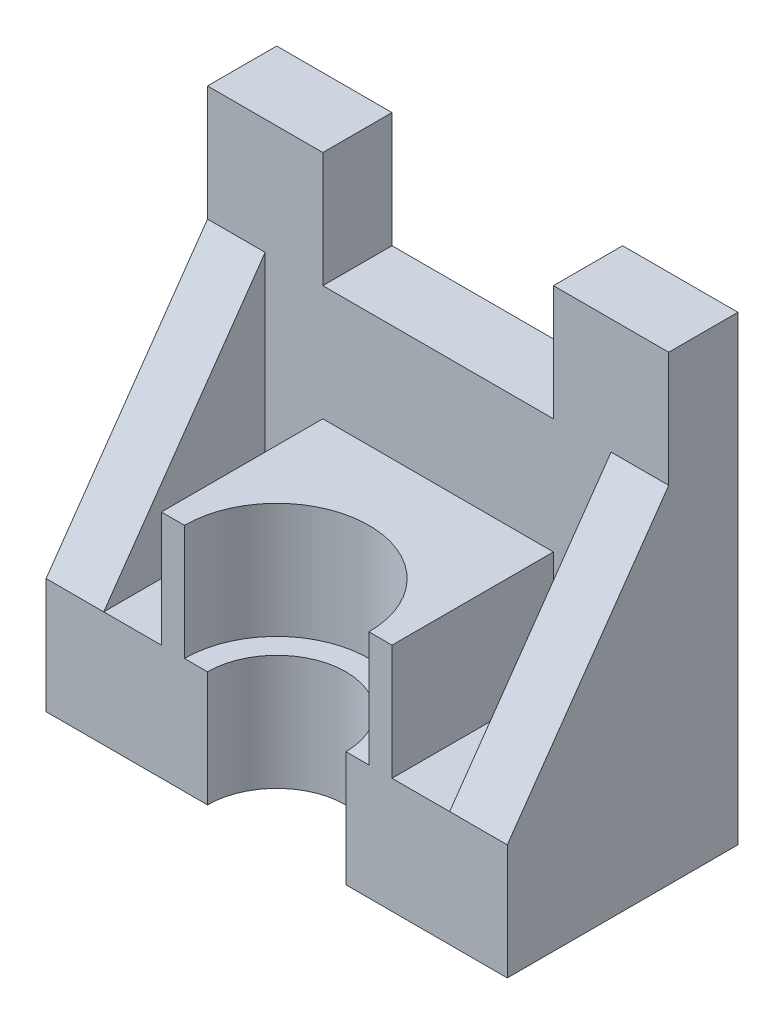
ISO-10303-21;
HEADER;
FILE_DESCRIPTION(('STEP AP214'),'2;1');
FILE_NAME('part.step','',(''),(''),'','','');
FILE_SCHEMA(('AUTOMOTIVE_DESIGN { 1 0 10303 214 1 1 1 1 }'));
ENDSEC;
DATA;
#1=APPLICATION_CONTEXT('core data for automotive mechanical design processes');
#2=APPLICATION_PROTOCOL_DEFINITION('international standard','automotive_design',2000,#1);
#3=PRODUCT_CONTEXT('',#1,'mechanical');
#4=PRODUCT('Part','Part','',(#3));
#5=PRODUCT_RELATED_PRODUCT_CATEGORY('part','',(#4));
#6=PRODUCT_DEFINITION_FORMATION('','',#4);
#7=PRODUCT_DEFINITION_CONTEXT('part definition',#1,'design');
#8=PRODUCT_DEFINITION('design','',#6,#7);
#9=PRODUCT_DEFINITION_SHAPE('','',#8);
#10=(LENGTH_UNIT() NAMED_UNIT(*) SI_UNIT(.MILLI.,.METRE.));
#11=(NAMED_UNIT(*) PLANE_ANGLE_UNIT() SI_UNIT($,.RADIAN.));
#12=(NAMED_UNIT(*) SI_UNIT($,.STERADIAN.) SOLID_ANGLE_UNIT());
#13=UNCERTAINTY_MEASURE_WITH_UNIT(LENGTH_MEASURE(1.E-05),#10,'distance_accuracy_value','');
#14=(GEOMETRIC_REPRESENTATION_CONTEXT(3) GLOBAL_UNCERTAINTY_ASSIGNED_CONTEXT((#13)) GLOBAL_UNIT_ASSIGNED_CONTEXT((#10,
#11,#12)) REPRESENTATION_CONTEXT('',''));
#15=CARTESIAN_POINT('',(0.,0.,0.));
#16=DIRECTION('',(0.,0.,1.));
#17=DIRECTION('',(1.,0.,0.));
#18=AXIS2_PLACEMENT_3D('',#15,#16,#17);
#19=CARTESIAN_POINT('',(-1.23991935483868,-132.714717741935,50.));
#20=DIRECTION('',(0.,1.,0.));
#21=DIRECTION('',(-1.,0.,0.));
#22=AXIS2_PLACEMENT_3D('',#19,#20,#21);
#23=CYLINDRICAL_SURFACE('',#22,15.);
#24=CARTESIAN_POINT('',(-1.2399193548387,-7.71471774193551,50.));
#25=DIRECTION('',(0.,1.,0.));
#26=DIRECTION('',(-1.,0.,0.));
#27=AXIS2_PLACEMENT_3D('',#24,#25,#26);
#28=CIRCLE('',#27,15.);
#29=CARTESIAN_POINT('',(-16.2399193548387,-7.71471774193551,50.));
#30=VERTEX_POINT('',#29);
#31=CARTESIAN_POINT('',(13.7600806451613,-7.71471774193551,50.));
#32=VERTEX_POINT('',#31);
#33=EDGE_CURVE('E43',#30,#32,#28,.F.);
#34=ORIENTED_EDGE('',*,*,#33,.F.);
#35=DIRECTION('',(0.,1.,0.));
#36=VECTOR('',#35,1.);
#37=CARTESIAN_POINT('',(-16.2399193548387,-132.714717741935,50.));
#38=LINE('',#37,#36);
#39=CARTESIAN_POINT('',(-16.2399193548387,-32.7147177419355,50.));
#40=VERTEX_POINT('',#39);
#41=EDGE_CURVE('E206',#30,#40,#38,.F.);
#42=ORIENTED_EDGE('',*,*,#41,.T.);
#43=CARTESIAN_POINT('',(-1.2399193548387,-32.7147177419355,50.));
#44=DIRECTION('',(0.,1.,0.));
#45=DIRECTION('',(0.,0.,1.));
#46=AXIS2_PLACEMENT_3D('',#43,#44,#45);
#47=CIRCLE('',#46,15.);
#48=CARTESIAN_POINT('',(13.7600806451613,-32.7147177419355,50.));
#49=VERTEX_POINT('',#48);
#50=EDGE_CURVE('E233',#49,#40,#47,.T.);
#51=ORIENTED_EDGE('',*,*,#50,.F.);
#52=DIRECTION('',(0.,1.,0.));
#53=VECTOR('',#52,1.);
#54=CARTESIAN_POINT('',(13.7600806451613,-132.714717741935,50.));
#55=LINE('',#54,#53);
#56=EDGE_CURVE('E209',#49,#32,#55,.T.);
#57=ORIENTED_EDGE('',*,*,#56,.T.);
#58=EDGE_LOOP('',(#34,#42,#51,#57));
#59=FACE_BOUND('',#58,.T.);
#60=ADVANCED_FACE('F35',(#59),#23,.F.);
#61=CARTESIAN_POINT('',(0.,0.,50.));
#62=DIRECTION('',(0.,0.,1.));
#63=DIRECTION('',(1.,0.,0.));
#64=AXIS2_PLACEMENT_3D('',#61,#62,#63);
#65=PLANE('',#64);
#66=DIRECTION('',(1.,0.,0.));
#67=VECTOR('',#66,1.);
#68=CARTESIAN_POINT('',(28.7600806451613,-7.7147177419355,50.));
#69=LINE('',#68,#67);
#70=CARTESIAN_POINT('',(36.2600806451613,-7.7147177419355,50.));
#71=VERTEX_POINT('',#70);
#72=CARTESIAN_POINT('',(48.7600806451613,-7.7147177419355,50.));
#73=VERTEX_POINT('',#72);
#74=EDGE_CURVE('E364',#71,#73,#69,.T.);
#75=ORIENTED_EDGE('',*,*,#74,.F.);
#76=DIRECTION('',(-1.,0.,0.));
#77=VECTOR('',#76,1.);
#78=CARTESIAN_POINT('',(0.,-7.71471774193551,50.));
#79=LINE('',#78,#77);
#80=CARTESIAN_POINT('',(23.7600806451613,-7.71471774193551,50.));
#81=VERTEX_POINT('',#80);
#82=EDGE_CURVE('E308',#71,#81,#79,.T.);
#83=ORIENTED_EDGE('',*,*,#82,.T.);
#84=DIRECTION('',(0.,1.,0.));
#85=VECTOR('',#84,1.);
#86=CARTESIAN_POINT('',(23.7600806451613,0.,50.));
#87=LINE('',#86,#85);
#88=CARTESIAN_POINT('',(23.7600806451613,17.2852822580645,50.));
#89=VERTEX_POINT('',#88);
#90=EDGE_CURVE('E310',#81,#89,#87,.T.);
#91=ORIENTED_EDGE('',*,*,#90,.T.);
#92=DIRECTION('',(-1.,0.,0.));
#93=VECTOR('',#92,1.);
#94=CARTESIAN_POINT('',(0.,17.2852822580645,50.));
#95=LINE('',#94,#93);
#96=CARTESIAN_POINT('',(18.7600806451613,17.2852822580645,50.));
#97=VERTEX_POINT('',#96);
#98=EDGE_CURVE('E313',#89,#97,#95,.T.);
#99=ORIENTED_EDGE('',*,*,#98,.T.);
#100=DIRECTION('',(0.,1.,0.));
#101=VECTOR('',#100,1.);
#102=CARTESIAN_POINT('',(18.7600806451613,-7.71471774193551,50.));
#103=LINE('',#102,#101);
#104=CARTESIAN_POINT('',(18.7600806451613,-7.71471774193551,50.));
#105=VERTEX_POINT('',#104);
#106=EDGE_CURVE('E230',#105,#97,#103,.T.);
#107=ORIENTED_EDGE('',*,*,#106,.F.);
#108=DIRECTION('',(-1.,0.,0.));
#109=VECTOR('',#108,1.);
#110=CARTESIAN_POINT('',(0.,-7.71471774193551,50.));
#111=LINE('',#110,#109);
#112=EDGE_CURVE('E219',#105,#32,#111,.T.);
#113=ORIENTED_EDGE('',*,*,#112,.T.);
#114=ORIENTED_EDGE('',*,*,#56,.F.);
#115=DIRECTION('',(1.,0.,0.));
#116=VECTOR('',#115,1.);
#117=CARTESIAN_POINT('',(0.,-32.7147177419355,50.));
#118=LINE('',#117,#116);
#119=CARTESIAN_POINT('',(48.7600806451613,-32.7147177419355,50.));
#120=VERTEX_POINT('',#119);
#121=EDGE_CURVE('E302',#49,#120,#118,.T.);
#122=ORIENTED_EDGE('',*,*,#121,.T.);
#123=DIRECTION('',(0.,1.,0.));
#124=VECTOR('',#123,1.);
#125=CARTESIAN_POINT('',(48.7600806451613,0.,50.));
#126=LINE('',#125,#124);
#127=EDGE_CURVE('E305',#120,#73,#126,.T.);
#128=ORIENTED_EDGE('',*,*,#127,.T.);
#129=EDGE_LOOP('',(#75,#83,#91,#99,#107,#113,#114,#122,#128));
#130=FACE_BOUND('',#129,.T.);
#131=ADVANCED_FACE('F227',(#130),#65,.T.);
#132=CARTESIAN_POINT('',(0.,-7.71471774193551,50.));
#133=DIRECTION('',(0.,-1.,0.));
#134=DIRECTION('',(0.,0.,-1.));
#135=AXIS2_PLACEMENT_3D('',#132,#133,#134);
#136=PLANE('',#135);
#137=DIRECTION('',(0.,0.,-1.));
#138=VECTOR('',#137,1.);
#139=CARTESIAN_POINT('',(-26.2399193548387,-7.71471774193551,50.));
#140=LINE('',#139,#138);
#141=CARTESIAN_POINT('',(-26.2399193548387,-7.71471774193551,50.));
#142=VERTEX_POINT('',#141);
#143=CARTESIAN_POINT('',(-26.2399193548387,-7.71471774193551,15.));
#144=VERTEX_POINT('',#143);
#145=EDGE_CURVE('E316',#142,#144,#140,.T.);
#146=ORIENTED_EDGE('',*,*,#145,.T.);
#147=DIRECTION('',(-1.,0.,0.));
#148=VECTOR('',#147,1.);
#149=CARTESIAN_POINT('',(0.,-7.71471774193551,15.));
#150=LINE('',#149,#148);
#151=CARTESIAN_POINT('',(-38.7399193548387,-7.71471774193551,15.));
#152=VERTEX_POINT('',#151);
#153=EDGE_CURVE('E58',#144,#152,#150,.T.);
#154=ORIENTED_EDGE('',*,*,#153,.T.);
#155=DIRECTION('',(0.,0.,-1.));
#156=VECTOR('',#155,1.);
#157=CARTESIAN_POINT('',(-38.7399193548387,-7.71471774193551,50.));
#158=LINE('',#157,#156);
#159=CARTESIAN_POINT('',(-38.7399193548387,-7.71471774193551,50.));
#160=VERTEX_POINT('',#159);
#161=EDGE_CURVE('E192',#160,#152,#158,.T.);
#162=ORIENTED_EDGE('',*,*,#161,.F.);
#163=DIRECTION('',(-1.,0.,0.));
#164=VECTOR('',#163,1.);
#165=CARTESIAN_POINT('',(0.,-7.71471774193551,50.));
#166=LINE('',#165,#164);
#167=EDGE_CURVE('E198',#142,#160,#166,.T.);
#168=ORIENTED_EDGE('',*,*,#167,.F.);
#169=EDGE_LOOP('',(#146,#154,#162,#168));
#170=FACE_BOUND('',#169,.T.);
#171=ADVANCED_FACE('F37',(#170),#136,.F.);
#172=CARTESIAN_POINT('',(-38.7399193548387,0.,50.));
#173=DIRECTION('',(1.,0.,0.));
#174=DIRECTION('',(0.,0.,-1.));
#175=AXIS2_PLACEMENT_3D('',#172,#173,#174);
#176=PLANE('',#175);
#177=DIRECTION('',(0.,0.81923192051904,-0.573462344363329));
#178=VECTOR('',#177,1.);
#179=CARTESIAN_POINT('',(-38.7399193548387,-7.71471774193551,50.));
#180=LINE('',#179,#178);
#181=CARTESIAN_POINT('',(-38.7399193548387,42.2852822580645,15.));
#182=VERTEX_POINT('',#181);
#183=EDGE_CURVE('E182',#160,#182,#180,.T.);
#184=ORIENTED_EDGE('',*,*,#183,.F.);
#185=ORIENTED_EDGE('',*,*,#161,.T.);
#186=DIRECTION('',(0.,-1.,0.));
#187=VECTOR('',#186,1.);
#188=CARTESIAN_POINT('',(-38.7399193548387,0.,15.));
#189=LINE('',#188,#187);
#190=EDGE_CURVE('E194',#182,#152,#189,.T.);
#191=ORIENTED_EDGE('',*,*,#190,.F.);
#192=EDGE_LOOP('',(#184,#185,#191));
#193=FACE_BOUND('',#192,.T.);
#194=ADVANCED_FACE('F191',(#193),#176,.T.);
#195=CARTESIAN_POINT('',(-51.2399193548387,0.,50.));
#196=DIRECTION('',(1.,0.,0.));
#197=DIRECTION('',(0.,0.,-1.));
#198=AXIS2_PLACEMENT_3D('',#195,#196,#197);
#199=PLANE('',#198);
#200=DIRECTION('',(0.,-1.,0.));
#201=VECTOR('',#200,1.);
#202=CARTESIAN_POINT('',(-51.2399193548387,0.,50.));
#203=LINE('',#202,#201);
#204=CARTESIAN_POINT('',(-51.2399193548387,-7.71471774193551,50.));
#205=VERTEX_POINT('',#204);
#206=CARTESIAN_POINT('',(-51.2399193548387,-32.7147177419355,50.));
#207=VERTEX_POINT('',#206);
#208=EDGE_CURVE('E203',#205,#207,#203,.T.);
#209=ORIENTED_EDGE('',*,*,#208,.F.);
#210=DIRECTION('',(0.,0.81923192051904,-0.573462344363329));
#211=VECTOR('',#210,1.);
#212=CARTESIAN_POINT('',(-51.2399193548387,-2.53705482788483,46.3756359601645));
#213=LINE('',#212,#211);
#214=CARTESIAN_POINT('',(-51.2399193548387,42.2852822580645,15.));
#215=VERTEX_POINT('',#214);
#216=EDGE_CURVE('E185',#205,#215,#213,.T.);
#217=ORIENTED_EDGE('',*,*,#216,.T.);
#218=DIRECTION('',(0.,-1.,0.));
#219=VECTOR('',#218,1.);
#220=CARTESIAN_POINT('',(-51.2399193548387,0.,15.));
#221=LINE('',#220,#219);
#222=CARTESIAN_POINT('',(-51.2399193548387,67.2852822580645,15.));
#223=VERTEX_POINT('',#222);
#224=EDGE_CURVE('E272',#223,#215,#221,.T.);
#225=ORIENTED_EDGE('',*,*,#224,.F.);
#226=DIRECTION('',(0.,0.,-1.));
#227=VECTOR('',#226,1.);
#228=CARTESIAN_POINT('',(-51.2399193548387,67.2852822580645,15.));
#229=LINE('',#228,#227);
#230=CARTESIAN_POINT('',(-51.2399193548387,67.2852822580645,0.));
#231=VERTEX_POINT('',#230);
#232=EDGE_CURVE('E274',#223,#231,#229,.T.);
#233=ORIENTED_EDGE('',*,*,#232,.T.);
#234=DIRECTION('',(0.,-1.,0.));
#235=VECTOR('',#234,1.);
#236=CARTESIAN_POINT('',(-51.2399193548387,0.,0.));
#237=LINE('',#236,#235);
#238=CARTESIAN_POINT('',(-51.2399193548387,-32.7147177419355,0.));
#239=VERTEX_POINT('',#238);
#240=EDGE_CURVE('E299',#231,#239,#237,.T.);
#241=ORIENTED_EDGE('',*,*,#240,.T.);
#242=DIRECTION('',(0.,0.,-1.));
#243=VECTOR('',#242,1.);
#244=CARTESIAN_POINT('',(-51.2399193548387,-32.7147177419355,50.));
#245=LINE('',#244,#243);
#246=EDGE_CURVE('E207',#207,#239,#245,.T.);
#247=ORIENTED_EDGE('',*,*,#246,.F.);
#248=EDGE_LOOP('',(#209,#217,#225,#233,#241,#247));
#249=FACE_BOUND('',#248,.T.);
#250=ADVANCED_FACE('F369',(#249),#199,.F.);
#251=CARTESIAN_POINT('',(0.,-32.7147177419355,50.));
#252=DIRECTION('',(0.,1.,0.));
#253=DIRECTION('',(0.,0.,1.));
#254=AXIS2_PLACEMENT_3D('',#251,#252,#253);
#255=PLANE('',#254);
#256=ORIENTED_EDGE('',*,*,#121,.F.);
#257=ORIENTED_EDGE('',*,*,#50,.T.);
#258=EDGE_CURVE('E303',#207,#40,#118,.T.);
#259=ORIENTED_EDGE('',*,*,#258,.F.);
#260=ORIENTED_EDGE('',*,*,#246,.T.);
#261=DIRECTION('',(1.,0.,0.));
#262=VECTOR('',#261,1.);
#263=CARTESIAN_POINT('',(0.,-32.7147177419355,0.));
#264=LINE('',#263,#262);
#265=CARTESIAN_POINT('',(48.7600806451613,-32.7147177419355,0.));
#266=VERTEX_POINT('',#265);
#267=EDGE_CURVE('E318',#239,#266,#264,.T.);
#268=ORIENTED_EDGE('',*,*,#267,.T.);
#269=DIRECTION('',(0.,0.,-1.));
#270=VECTOR('',#269,1.);
#271=CARTESIAN_POINT('',(48.7600806451613,-32.7147177419355,50.));
#272=LINE('',#271,#270);
#273=EDGE_CURVE('E212',#120,#266,#272,.T.);
#274=ORIENTED_EDGE('',*,*,#273,.F.);
#275=EDGE_LOOP('',(#256,#257,#259,#260,#268,#274));
#276=FACE_BOUND('',#275,.T.);
#277=ADVANCED_FACE('F367',(#276),#255,.F.);
#278=CARTESIAN_POINT('',(48.7600806451613,0.,50.));
#279=DIRECTION('',(-1.,0.,0.));
#280=DIRECTION('',(0.,0.,1.));
#281=AXIS2_PLACEMENT_3D('',#278,#279,#280);
#282=PLANE('',#281);
#283=DIRECTION('',(0.,1.,0.));
#284=VECTOR('',#283,1.);
#285=CARTESIAN_POINT('',(48.7600806451613,0.,15.));
#286=LINE('',#285,#284);
#287=CARTESIAN_POINT('',(48.7600806451613,42.2852822580645,15.));
#288=VERTEX_POINT('',#287);
#289=CARTESIAN_POINT('',(48.7600806451613,67.2852822580645,15.));
#290=VERTEX_POINT('',#289);
#291=EDGE_CURVE('E260',#288,#290,#286,.T.);
#292=ORIENTED_EDGE('',*,*,#291,.F.);
#293=DIRECTION('',(0.,0.81923192051904,-0.573462344363328));
#294=VECTOR('',#293,1.);
#295=CARTESIAN_POINT('',(48.7600806451613,20.9528780580212,29.9326829400303));
#296=LINE('',#295,#294);
#297=EDGE_CURVE('E362',#73,#288,#296,.T.);
#298=ORIENTED_EDGE('',*,*,#297,.F.);
#299=ORIENTED_EDGE('',*,*,#127,.F.);
#300=ORIENTED_EDGE('',*,*,#273,.T.);
#301=DIRECTION('',(0.,1.,0.));
#302=VECTOR('',#301,1.);
#303=CARTESIAN_POINT('',(48.7600806451613,0.,0.));
#304=LINE('',#303,#302);
#305=CARTESIAN_POINT('',(48.7600806451613,67.2852822580645,0.));
#306=VERTEX_POINT('',#305);
#307=EDGE_CURVE('E204',#266,#306,#304,.T.);
#308=ORIENTED_EDGE('',*,*,#307,.T.);
#309=DIRECTION('',(0.,0.,-1.));
#310=VECTOR('',#309,1.);
#311=CARTESIAN_POINT('',(48.7600806451613,67.2852822580645,15.));
#312=LINE('',#311,#310);
#313=EDGE_CURVE('E297',#290,#306,#312,.T.);
#314=ORIENTED_EDGE('',*,*,#313,.F.);
#315=EDGE_LOOP('',(#292,#298,#299,#300,#308,#314));
#316=FACE_BOUND('',#315,.T.);
#317=ADVANCED_FACE('F339',(#316),#282,.F.);
#318=CARTESIAN_POINT('',(36.2600806451613,0.,50.));
#319=DIRECTION('',(1.,0.,0.));
#320=DIRECTION('',(0.,0.,-1.));
#321=AXIS2_PLACEMENT_3D('',#318,#319,#320);
#322=PLANE('',#321);
#323=DIRECTION('',(0.,0.,-1.));
#324=VECTOR('',#323,1.);
#325=CARTESIAN_POINT('',(36.2600806451613,-7.7147177419355,50.));
#326=LINE('',#325,#324);
#327=CARTESIAN_POINT('',(36.2600806451613,-7.7147177419355,15.));
#328=VERTEX_POINT('',#327);
#329=EDGE_CURVE('E331',#71,#328,#326,.T.);
#330=ORIENTED_EDGE('',*,*,#329,.F.);
#331=DIRECTION('',(0.,0.81923192051904,-0.573462344363328));
#332=VECTOR('',#331,1.);
#333=CARTESIAN_POINT('',(36.2600806451613,-2.53705482788483,46.3756359601645));
#334=LINE('',#333,#332);
#335=CARTESIAN_POINT('',(36.2600806451613,42.2852822580645,15.));
#336=VERTEX_POINT('',#335);
#337=EDGE_CURVE('E432',#71,#336,#334,.T.);
#338=ORIENTED_EDGE('',*,*,#337,.T.);
#339=DIRECTION('',(0.,-1.,0.));
#340=VECTOR('',#339,1.);
#341=CARTESIAN_POINT('',(36.2600806451613,0.,15.));
#342=LINE('',#341,#340);
#343=EDGE_CURVE('E256',#336,#328,#342,.T.);
#344=ORIENTED_EDGE('',*,*,#343,.T.);
#345=EDGE_LOOP('',(#330,#338,#344));
#346=FACE_BOUND('',#345,.T.);
#347=ADVANCED_FACE('F375',(#346),#322,.F.);
#348=CARTESIAN_POINT('',(0.,-7.71471774193551,50.));
#349=DIRECTION('',(0.,-1.,0.));
#350=DIRECTION('',(1.,0.,0.));
#351=AXIS2_PLACEMENT_3D('',#348,#349,#350);
#352=PLANE('',#351);
#353=ORIENTED_EDGE('',*,*,#329,.T.);
#354=DIRECTION('',(-1.,0.,0.));
#355=VECTOR('',#354,1.);
#356=CARTESIAN_POINT('',(0.,-7.71471774193551,15.));
#357=LINE('',#356,#355);
#358=CARTESIAN_POINT('',(23.7600806451613,-7.71471774193551,15.));
#359=VERTEX_POINT('',#358);
#360=EDGE_CURVE('E254',#328,#359,#357,.T.);
#361=ORIENTED_EDGE('',*,*,#360,.T.);
#362=DIRECTION('',(0.,0.,-1.));
#363=VECTOR('',#362,1.);
#364=CARTESIAN_POINT('',(23.7600806451613,-7.71471774193551,50.));
#365=LINE('',#364,#363);
#366=EDGE_CURVE('E328',#81,#359,#365,.T.);
#367=ORIENTED_EDGE('',*,*,#366,.F.);
#368=ORIENTED_EDGE('',*,*,#82,.F.);
#369=EDGE_LOOP('',(#353,#361,#367,#368));
#370=FACE_BOUND('',#369,.T.);
#371=ADVANCED_FACE('F421',(#370),#352,.F.);
#372=CARTESIAN_POINT('',(23.7600806451613,0.,50.));
#373=DIRECTION('',(-1.,0.,0.));
#374=DIRECTION('',(0.,0.,1.));
#375=AXIS2_PLACEMENT_3D('',#372,#373,#374);
#376=PLANE('',#375);
#377=ORIENTED_EDGE('',*,*,#366,.T.);
#378=DIRECTION('',(0.,1.,0.));
#379=VECTOR('',#378,1.);
#380=CARTESIAN_POINT('',(23.7600806451613,0.,15.));
#381=LINE('',#380,#379);
#382=CARTESIAN_POINT('',(23.7600806451613,17.2852822580645,15.));
#383=VERTEX_POINT('',#382);
#384=EDGE_CURVE('E252',#359,#383,#381,.T.);
#385=ORIENTED_EDGE('',*,*,#384,.T.);
#386=DIRECTION('',(0.,0.,-1.));
#387=VECTOR('',#386,1.);
#388=CARTESIAN_POINT('',(23.7600806451613,17.2852822580645,50.));
#389=LINE('',#388,#387);
#390=EDGE_CURVE('E325',#89,#383,#389,.T.);
#391=ORIENTED_EDGE('',*,*,#390,.F.);
#392=ORIENTED_EDGE('',*,*,#90,.F.);
#393=EDGE_LOOP('',(#377,#385,#391,#392));
#394=FACE_BOUND('',#393,.T.);
#395=ADVANCED_FACE('F417',(#394),#376,.F.);
#396=CARTESIAN_POINT('',(0.,17.2852822580645,50.));
#397=DIRECTION('',(0.,-1.,0.));
#398=DIRECTION('',(1.,0.,0.));
#399=AXIS2_PLACEMENT_3D('',#396,#397,#398);
#400=PLANE('',#399);
#401=CARTESIAN_POINT('',(-21.2399193548387,17.2852822580645,50.));
#402=VERTEX_POINT('',#401);
#403=CARTESIAN_POINT('',(-26.2399193548387,17.2852822580645,50.));
#404=VERTEX_POINT('',#403);
#405=EDGE_CURVE('E312',#402,#404,#95,.T.);
#406=ORIENTED_EDGE('',*,*,#405,.F.);
#407=CARTESIAN_POINT('',(-1.23991935483871,17.2852822580645,50.));
#408=DIRECTION('',(0.,1.,0.));
#409=DIRECTION('',(-1.,0.,0.));
#410=AXIS2_PLACEMENT_3D('',#407,#408,#409);
#411=CIRCLE('',#410,20.);
#412=EDGE_CURVE('E442',#97,#402,#411,.T.);
#413=ORIENTED_EDGE('',*,*,#412,.F.);
#414=ORIENTED_EDGE('',*,*,#98,.F.);
#415=ORIENTED_EDGE('',*,*,#390,.T.);
#416=DIRECTION('',(-1.,0.,0.));
#417=VECTOR('',#416,1.);
#418=CARTESIAN_POINT('',(0.,17.2852822580645,15.));
#419=LINE('',#418,#417);
#420=CARTESIAN_POINT('',(-26.2399193548387,17.2852822580645,15.));
#421=VERTEX_POINT('',#420);
#422=EDGE_CURVE('E250',#383,#421,#419,.T.);
#423=ORIENTED_EDGE('',*,*,#422,.T.);
#424=DIRECTION('',(0.,0.,-1.));
#425=VECTOR('',#424,1.);
#426=CARTESIAN_POINT('',(-26.2399193548387,17.2852822580645,50.));
#427=LINE('',#426,#425);
#428=EDGE_CURVE('E322',#404,#421,#427,.T.);
#429=ORIENTED_EDGE('',*,*,#428,.F.);
#430=EDGE_LOOP('',(#406,#413,#414,#415,#423,#429));
#431=FACE_BOUND('',#430,.T.);
#432=ADVANCED_FACE('F413',(#431),#400,.F.);
#433=CARTESIAN_POINT('',(-26.2399193548387,0.,50.));
#434=DIRECTION('',(1.,0.,0.));
#435=DIRECTION('',(0.,0.,-1.));
#436=AXIS2_PLACEMENT_3D('',#433,#434,#435);
#437=PLANE('',#436);
#438=ORIENTED_EDGE('',*,*,#428,.T.);
#439=DIRECTION('',(0.,-1.,0.));
#440=VECTOR('',#439,1.);
#441=CARTESIAN_POINT('',(-26.2399193548387,0.,15.));
#442=LINE('',#441,#440);
#443=EDGE_CURVE('E248',#421,#144,#442,.T.);
#444=ORIENTED_EDGE('',*,*,#443,.T.);
#445=ORIENTED_EDGE('',*,*,#145,.F.);
#446=DIRECTION('',(0.,-1.,0.));
#447=VECTOR('',#446,1.);
#448=CARTESIAN_POINT('',(-26.2399193548387,0.,50.));
#449=LINE('',#448,#447);
#450=EDGE_CURVE('E201',#404,#142,#449,.T.);
#451=ORIENTED_EDGE('',*,*,#450,.F.);
#452=EDGE_LOOP('',(#438,#444,#445,#451));
#453=FACE_BOUND('',#452,.T.);
#454=ADVANCED_FACE('F408',(#453),#437,.F.);
#455=DIRECTION('',(1.,0.,0.));
#456=VECTOR('',#455,1.);
#457=CARTESIAN_POINT('',(-58.7399193548387,-7.71471774193551,50.));
#458=LINE('',#457,#456);
#459=EDGE_CURVE('E179',#205,#160,#458,.T.);
#460=ORIENTED_EDGE('',*,*,#459,.F.);
#461=ORIENTED_EDGE('',*,*,#208,.T.);
#462=ORIENTED_EDGE('',*,*,#258,.T.);
#463=ORIENTED_EDGE('',*,*,#41,.F.);
#464=DIRECTION('',(-1.,0.,0.));
#465=VECTOR('',#464,1.);
#466=CARTESIAN_POINT('',(0.,-7.71471774193551,50.));
#467=LINE('',#466,#465);
#468=CARTESIAN_POINT('',(-21.2399193548387,-7.71471774193551,50.));
#469=VERTEX_POINT('',#468);
#470=EDGE_CURVE('E50',#30,#469,#467,.T.);
#471=ORIENTED_EDGE('',*,*,#470,.T.);
#472=DIRECTION('',(0.,1.,0.));
#473=VECTOR('',#472,1.);
#474=CARTESIAN_POINT('',(-21.2399193548387,-7.71471774193551,50.));
#475=LINE('',#474,#473);
#476=EDGE_CURVE('E11',#402,#469,#475,.F.);
#477=ORIENTED_EDGE('',*,*,#476,.F.);
#478=ORIENTED_EDGE('',*,*,#405,.T.);
#479=ORIENTED_EDGE('',*,*,#450,.T.);
#480=ORIENTED_EDGE('',*,*,#167,.T.);
#481=EDGE_LOOP('',(#460,#461,#462,#463,#471,#477,#478,#479,#480));
#482=FACE_BOUND('',#481,.T.);
#483=ADVANCED_FACE('F199',(#482),#65,.T.);
#484=CARTESIAN_POINT('',(0.,0.,0.));
#485=DIRECTION('',(0.,0.,1.));
#486=DIRECTION('',(1.,0.,0.));
#487=AXIS2_PLACEMENT_3D('',#484,#485,#486);
#488=PLANE('',#487);
#489=ORIENTED_EDGE('',*,*,#240,.F.);
#490=DIRECTION('',(-1.,0.,0.));
#491=VECTOR('',#490,1.);
#492=CARTESIAN_POINT('',(0.,67.2852822580645,0.));
#493=LINE('',#492,#491);
#494=CARTESIAN_POINT('',(-26.2399193548387,67.2852822580645,0.));
#495=VERTEX_POINT('',#494);
#496=EDGE_CURVE('E245',#495,#231,#493,.T.);
#497=ORIENTED_EDGE('',*,*,#496,.F.);
#498=DIRECTION('',(0.,1.,0.));
#499=VECTOR('',#498,1.);
#500=CARTESIAN_POINT('',(-26.2399193548387,0.,0.));
#501=LINE('',#500,#499);
#502=CARTESIAN_POINT('',(-26.2399193548387,42.2852822580645,0.));
#503=VERTEX_POINT('',#502);
#504=EDGE_CURVE('E279',#503,#495,#501,.T.);
#505=ORIENTED_EDGE('',*,*,#504,.F.);
#506=DIRECTION('',(-1.,0.,0.));
#507=VECTOR('',#506,1.);
#508=CARTESIAN_POINT('',(0.,42.2852822580645,0.));
#509=LINE('',#508,#507);
#510=CARTESIAN_POINT('',(23.7600806451613,42.2852822580645,0.));
#511=VERTEX_POINT('',#510);
#512=EDGE_CURVE('E277',#511,#503,#509,.T.);
#513=ORIENTED_EDGE('',*,*,#512,.F.);
#514=DIRECTION('',(0.,-1.,0.));
#515=VECTOR('',#514,1.);
#516=CARTESIAN_POINT('',(23.7600806451613,0.,0.));
#517=LINE('',#516,#515);
#518=CARTESIAN_POINT('',(23.7600806451613,67.2852822580645,0.));
#519=VERTEX_POINT('',#518);
#520=EDGE_CURVE('E239',#519,#511,#517,.T.);
#521=ORIENTED_EDGE('',*,*,#520,.F.);
#522=DIRECTION('',(-1.,0.,0.));
#523=VECTOR('',#522,1.);
#524=CARTESIAN_POINT('',(0.,67.2852822580645,0.));
#525=LINE('',#524,#523);
#526=EDGE_CURVE('E237',#306,#519,#525,.T.);
#527=ORIENTED_EDGE('',*,*,#526,.F.);
#528=ORIENTED_EDGE('',*,*,#307,.F.);
#529=ORIENTED_EDGE('',*,*,#267,.F.);
#530=EDGE_LOOP('',(#489,#497,#505,#513,#521,#527,#528,#529));
#531=FACE_BOUND('',#530,.T.);
#532=ADVANCED_FACE('F345',(#531),#488,.F.);
#533=CARTESIAN_POINT('',(0.,67.2852822580645,15.));
#534=DIRECTION('',(0.,-1.,0.));
#535=DIRECTION('',(0.,0.,-1.));
#536=AXIS2_PLACEMENT_3D('',#533,#534,#535);
#537=PLANE('',#536);
#538=ORIENTED_EDGE('',*,*,#526,.T.);
#539=DIRECTION('',(0.,0.,-1.));
#540=VECTOR('',#539,1.);
#541=CARTESIAN_POINT('',(23.7600806451613,67.2852822580645,15.));
#542=LINE('',#541,#540);
#543=CARTESIAN_POINT('',(23.7600806451613,67.2852822580645,15.));
#544=VERTEX_POINT('',#543);
#545=EDGE_CURVE('E294',#544,#519,#542,.T.);
#546=ORIENTED_EDGE('',*,*,#545,.F.);
#547=DIRECTION('',(-1.,0.,0.));
#548=VECTOR('',#547,1.);
#549=CARTESIAN_POINT('',(0.,67.2852822580645,15.));
#550=LINE('',#549,#548);
#551=EDGE_CURVE('E262',#290,#544,#550,.T.);
#552=ORIENTED_EDGE('',*,*,#551,.F.);
#553=ORIENTED_EDGE('',*,*,#313,.T.);
#554=EDGE_LOOP('',(#538,#546,#552,#553));
#555=FACE_BOUND('',#554,.T.);
#556=ADVANCED_FACE('F350',(#555),#537,.F.);
#557=CARTESIAN_POINT('',(23.7600806451613,0.,15.));
#558=DIRECTION('',(1.,0.,0.));
#559=DIRECTION('',(0.,1.,0.));
#560=AXIS2_PLACEMENT_3D('',#557,#558,#559);
#561=PLANE('',#560);
#562=ORIENTED_EDGE('',*,*,#520,.T.);
#563=DIRECTION('',(0.,0.,-1.));
#564=VECTOR('',#563,1.);
#565=CARTESIAN_POINT('',(23.7600806451613,42.2852822580645,15.));
#566=LINE('',#565,#564);
#567=CARTESIAN_POINT('',(23.7600806451613,42.2852822580645,15.));
#568=VERTEX_POINT('',#567);
#569=EDGE_CURVE('E291',#568,#511,#566,.T.);
#570=ORIENTED_EDGE('',*,*,#569,.F.);
#571=DIRECTION('',(0.,-1.,0.));
#572=VECTOR('',#571,1.);
#573=CARTESIAN_POINT('',(23.7600806451613,0.,15.));
#574=LINE('',#573,#572);
#575=EDGE_CURVE('E264',#544,#568,#574,.T.);
#576=ORIENTED_EDGE('',*,*,#575,.F.);
#577=ORIENTED_EDGE('',*,*,#545,.T.);
#578=EDGE_LOOP('',(#562,#570,#576,#577));
#579=FACE_BOUND('',#578,.T.);
#580=ADVANCED_FACE('F354',(#579),#561,.F.);
#581=CARTESIAN_POINT('',(0.,42.2852822580645,15.));
#582=DIRECTION('',(0.,-1.,0.));
#583=DIRECTION('',(0.,0.,-1.));
#584=AXIS2_PLACEMENT_3D('',#581,#582,#583);
#585=PLANE('',#584);
#586=ORIENTED_EDGE('',*,*,#512,.T.);
#587=DIRECTION('',(0.,0.,-1.));
#588=VECTOR('',#587,1.);
#589=CARTESIAN_POINT('',(-26.2399193548387,42.2852822580645,15.));
#590=LINE('',#589,#588);
#591=CARTESIAN_POINT('',(-26.2399193548387,42.2852822580645,15.));
#592=VERTEX_POINT('',#591);
#593=EDGE_CURVE('E288',#592,#503,#590,.T.);
#594=ORIENTED_EDGE('',*,*,#593,.F.);
#595=DIRECTION('',(-1.,0.,0.));
#596=VECTOR('',#595,1.);
#597=CARTESIAN_POINT('',(0.,42.2852822580645,15.));
#598=LINE('',#597,#596);
#599=EDGE_CURVE('E266',#568,#592,#598,.T.);
#600=ORIENTED_EDGE('',*,*,#599,.F.);
#601=ORIENTED_EDGE('',*,*,#569,.T.);
#602=EDGE_LOOP('',(#586,#594,#600,#601));
#603=FACE_BOUND('',#602,.T.);
#604=ADVANCED_FACE('F398',(#603),#585,.F.);
#605=CARTESIAN_POINT('',(-26.2399193548387,0.,15.));
#606=DIRECTION('',(-1.,0.,0.));
#607=DIRECTION('',(0.,0.,1.));
#608=AXIS2_PLACEMENT_3D('',#605,#606,#607);
#609=PLANE('',#608);
#610=ORIENTED_EDGE('',*,*,#504,.T.);
#611=DIRECTION('',(0.,0.,-1.));
#612=VECTOR('',#611,1.);
#613=CARTESIAN_POINT('',(-26.2399193548387,67.2852822580645,15.));
#614=LINE('',#613,#612);
#615=CARTESIAN_POINT('',(-26.2399193548387,67.2852822580645,15.));
#616=VERTEX_POINT('',#615);
#617=EDGE_CURVE('E285',#616,#495,#614,.T.);
#618=ORIENTED_EDGE('',*,*,#617,.F.);
#619=DIRECTION('',(0.,1.,0.));
#620=VECTOR('',#619,1.);
#621=CARTESIAN_POINT('',(-26.2399193548387,0.,15.));
#622=LINE('',#621,#620);
#623=EDGE_CURVE('E268',#592,#616,#622,.T.);
#624=ORIENTED_EDGE('',*,*,#623,.F.);
#625=ORIENTED_EDGE('',*,*,#593,.T.);
#626=EDGE_LOOP('',(#610,#618,#624,#625));
#627=FACE_BOUND('',#626,.T.);
#628=ADVANCED_FACE('F394',(#627),#609,.F.);
#629=CARTESIAN_POINT('',(0.,67.2852822580645,15.));
#630=DIRECTION('',(0.,-1.,0.));
#631=DIRECTION('',(0.,0.,-1.));
#632=AXIS2_PLACEMENT_3D('',#629,#630,#631);
#633=PLANE('',#632);
#634=ORIENTED_EDGE('',*,*,#496,.T.);
#635=ORIENTED_EDGE('',*,*,#232,.F.);
#636=DIRECTION('',(-1.,0.,0.));
#637=VECTOR('',#636,1.);
#638=CARTESIAN_POINT('',(0.,67.2852822580645,15.));
#639=LINE('',#638,#637);
#640=EDGE_CURVE('E270',#616,#223,#639,.T.);
#641=ORIENTED_EDGE('',*,*,#640,.F.);
#642=ORIENTED_EDGE('',*,*,#617,.T.);
#643=EDGE_LOOP('',(#634,#635,#641,#642));
#644=FACE_BOUND('',#643,.T.);
#645=ADVANCED_FACE('F391',(#644),#633,.F.);
#646=CARTESIAN_POINT('',(0.,0.,15.));
#647=DIRECTION('',(0.,0.,1.));
#648=DIRECTION('',(1.,0.,0.));
#649=AXIS2_PLACEMENT_3D('',#646,#647,#648);
#650=PLANE('',#649);
#651=ORIENTED_EDGE('',*,*,#343,.F.);
#652=DIRECTION('',(-1.,0.,0.));
#653=VECTOR('',#652,1.);
#654=CARTESIAN_POINT('',(0.,42.2852822580645,15.));
#655=LINE('',#654,#653);
#656=EDGE_CURVE('E258',#288,#336,#655,.T.);
#657=ORIENTED_EDGE('',*,*,#656,.F.);
#658=ORIENTED_EDGE('',*,*,#291,.T.);
#659=ORIENTED_EDGE('',*,*,#551,.T.);
#660=ORIENTED_EDGE('',*,*,#575,.T.);
#661=ORIENTED_EDGE('',*,*,#599,.T.);
#662=ORIENTED_EDGE('',*,*,#623,.T.);
#663=ORIENTED_EDGE('',*,*,#640,.T.);
#664=ORIENTED_EDGE('',*,*,#224,.T.);
#665=DIRECTION('',(1.,0.,0.));
#666=VECTOR('',#665,1.);
#667=CARTESIAN_POINT('',(0.,42.2852822580645,15.));
#668=LINE('',#667,#666);
#669=EDGE_CURVE('E243',#215,#182,#668,.T.);
#670=ORIENTED_EDGE('',*,*,#669,.T.);
#671=ORIENTED_EDGE('',*,*,#190,.T.);
#672=ORIENTED_EDGE('',*,*,#153,.F.);
#673=ORIENTED_EDGE('',*,*,#443,.F.);
#674=ORIENTED_EDGE('',*,*,#422,.F.);
#675=ORIENTED_EDGE('',*,*,#384,.F.);
#676=ORIENTED_EDGE('',*,*,#360,.F.);
#677=EDGE_LOOP('',(#651,#657,#658,#659,#660,#661,#662,#663,#664,#670,#671,#672,#673,#674,#675,#676));
#678=FACE_BOUND('',#677,.T.);
#679=ADVANCED_FACE('F359',(#678),#650,.T.);
#680=CARTESIAN_POINT('',(-1.2399193548387,-7.71471774193551,50.));
#681=DIRECTION('',(0.,1.,0.));
#682=DIRECTION('',(-1.,0.,0.));
#683=AXIS2_PLACEMENT_3D('',#680,#681,#682);
#684=CYLINDRICAL_SURFACE('',#683,20.);
#685=ORIENTED_EDGE('',*,*,#106,.T.);
#686=ORIENTED_EDGE('',*,*,#412,.T.);
#687=ORIENTED_EDGE('',*,*,#476,.T.);
#688=CARTESIAN_POINT('',(-1.2399193548387,-7.71471774193551,50.));
#689=DIRECTION('',(0.,1.,0.));
#690=DIRECTION('',(-1.,0.,0.));
#691=AXIS2_PLACEMENT_3D('',#688,#689,#690);
#692=CIRCLE('',#691,20.);
#693=EDGE_CURVE('E446',#105,#469,#692,.T.);
#694=ORIENTED_EDGE('',*,*,#693,.F.);
#695=EDGE_LOOP('',(#685,#686,#687,#694));
#696=FACE_BOUND('',#695,.T.);
#697=ADVANCED_FACE('F387',(#696),#684,.F.);
#698=CARTESIAN_POINT('',(-1.2399193548387,-7.71471774193551,50.));
#699=DIRECTION('',(0.,1.,0.));
#700=DIRECTION('',(-1.,0.,0.));
#701=AXIS2_PLACEMENT_3D('',#698,#699,#700);
#702=PLANE('',#701);
#703=ORIENTED_EDGE('',*,*,#693,.T.);
#704=ORIENTED_EDGE('',*,*,#470,.F.);
#705=ORIENTED_EDGE('',*,*,#33,.T.);
#706=ORIENTED_EDGE('',*,*,#112,.F.);
#707=EDGE_LOOP('',(#703,#704,#705,#706));
#708=FACE_BOUND('',#707,.T.);
#709=ADVANCED_FACE('F218',(#708),#702,.T.);
#710=CARTESIAN_POINT('',(28.7600806451613,20.9528780580212,29.9326829400303));
#711=DIRECTION('',(0.,-0.573462344363328,-0.81923192051904));
#712=DIRECTION('',(0.,0.81923192051904,-0.573462344363328));
#713=AXIS2_PLACEMENT_3D('',#710,#711,#712);
#714=PLANE('',#713);
#715=ORIENTED_EDGE('',*,*,#74,.T.);
#716=ORIENTED_EDGE('',*,*,#297,.T.);
#717=ORIENTED_EDGE('',*,*,#656,.T.);
#718=ORIENTED_EDGE('',*,*,#337,.F.);
#719=EDGE_LOOP('',(#715,#716,#717,#718));
#720=FACE_BOUND('',#719,.T.);
#721=ADVANCED_FACE('F461',(#720),#714,.F.);
#722=CARTESIAN_POINT('',(-58.7399193548387,-7.71471774193551,50.));
#723=DIRECTION('',(0.,-0.573462344363329,-0.81923192051904));
#724=DIRECTION('',(0.,0.81923192051904,-0.573462344363329));
#725=AXIS2_PLACEMENT_3D('',#722,#723,#724);
#726=PLANE('',#725);
#727=ORIENTED_EDGE('',*,*,#459,.T.);
#728=ORIENTED_EDGE('',*,*,#183,.T.);
#729=ORIENTED_EDGE('',*,*,#669,.F.);
#730=ORIENTED_EDGE('',*,*,#216,.F.);
#731=EDGE_LOOP('',(#727,#728,#729,#730));
#732=FACE_BOUND('',#731,.T.);
#733=ADVANCED_FACE('F181',(#732),#726,.F.);
#734=CLOSED_SHELL('',(#60,#131,#171,#194,#250,#277,#317,#347,#371,#395,#432,#454,#483,#532,#556,
#580,#604,#628,#645,#679,#697,#709,#721,#733));
#735=MANIFOLD_SOLID_BREP('B2',#734);
#736=ADVANCED_BREP_SHAPE_REPRESENTATION('',(#18,#735),#14);
#737=SHAPE_DEFINITION_REPRESENTATION(#9,#736);
ENDSEC;
END-ISO-10303-21;
